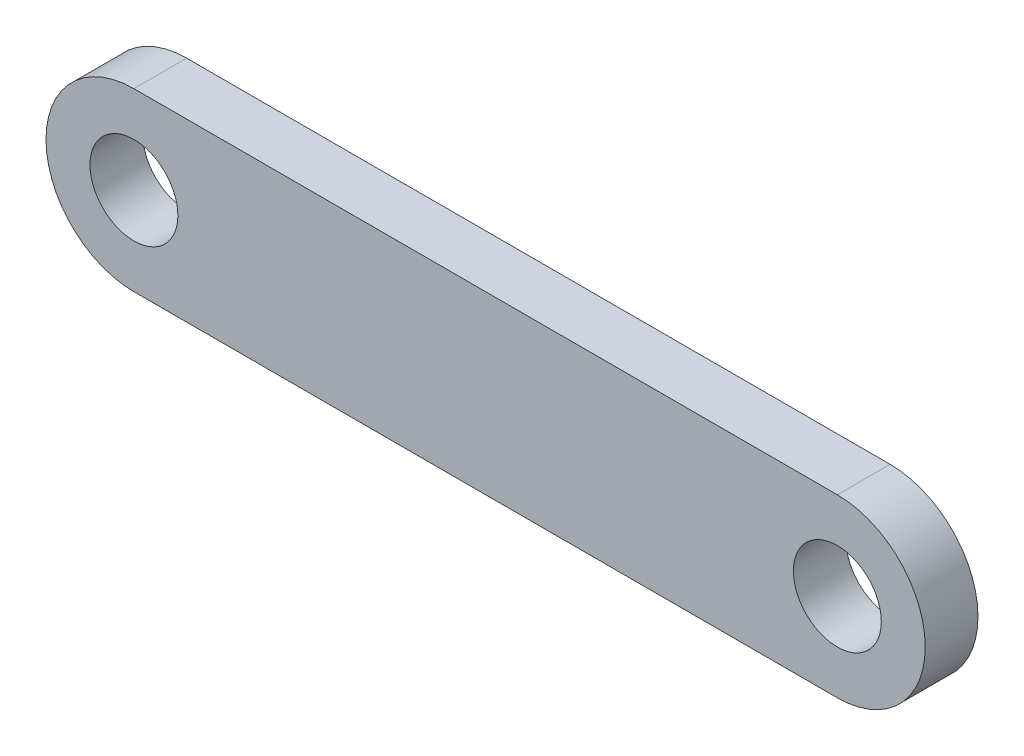
ISO-10303-21;
HEADER;
FILE_DESCRIPTION(('STEP AP214'),'2;1');
FILE_NAME('part.step','',(''),(''),'','','');
FILE_SCHEMA(('AUTOMOTIVE_DESIGN { 1 0 10303 214 1 1 1 1 }'));
ENDSEC;
DATA;
#1=APPLICATION_CONTEXT('core data for automotive mechanical design processes');
#2=APPLICATION_PROTOCOL_DEFINITION('international standard','automotive_design',2000,#1);
#3=PRODUCT_CONTEXT('',#1,'mechanical');
#4=PRODUCT('Part','Part','',(#3));
#5=PRODUCT_RELATED_PRODUCT_CATEGORY('part','',(#4));
#6=PRODUCT_DEFINITION_FORMATION('','',#4);
#7=PRODUCT_DEFINITION_CONTEXT('part definition',#1,'design');
#8=PRODUCT_DEFINITION('design','',#6,#7);
#9=PRODUCT_DEFINITION_SHAPE('','',#8);
#10=(LENGTH_UNIT() NAMED_UNIT(*) SI_UNIT(.MILLI.,.METRE.));
#11=(NAMED_UNIT(*) PLANE_ANGLE_UNIT() SI_UNIT($,.RADIAN.));
#12=(NAMED_UNIT(*) SI_UNIT($,.STERADIAN.) SOLID_ANGLE_UNIT());
#13=UNCERTAINTY_MEASURE_WITH_UNIT(LENGTH_MEASURE(1.E-05),#10,'distance_accuracy_value','');
#14=(GEOMETRIC_REPRESENTATION_CONTEXT(3) GLOBAL_UNCERTAINTY_ASSIGNED_CONTEXT((#13)) GLOBAL_UNIT_ASSIGNED_CONTEXT((#10,
#11,#12)) REPRESENTATION_CONTEXT('',''));
#15=CARTESIAN_POINT('',(0.,0.,0.));
#16=DIRECTION('',(0.,0.,1.));
#17=DIRECTION('',(1.,0.,0.));
#18=AXIS2_PLACEMENT_3D('',#15,#16,#17);
#19=CARTESIAN_POINT('',(10.,-5.,-3.));
#20=DIRECTION('',(0.,1.,0.));
#21=DIRECTION('',(-1.,0.,0.));
#22=AXIS2_PLACEMENT_3D('',#19,#20,#21);
#23=PLANE('',#22);
#24=DIRECTION('',(-1.,0.,0.));
#25=VECTOR('',#24,1.);
#26=CARTESIAN_POINT('',(10.,-5.,0.));
#27=LINE('',#26,#25);
#28=CARTESIAN_POINT('',(20.,-5.,0.));
#29=VERTEX_POINT('',#28);
#30=CARTESIAN_POINT('',(-20.,-5.,0.));
#31=VERTEX_POINT('',#30);
#32=EDGE_CURVE('E45',#29,#31,#27,.T.);
#33=ORIENTED_EDGE('',*,*,#32,.T.);
#34=DIRECTION('',(0.,0.,1.));
#35=VECTOR('',#34,1.);
#36=CARTESIAN_POINT('',(-20.,-5.,-21.0277563773199));
#37=LINE('',#36,#35);
#38=CARTESIAN_POINT('',(-20.,-5.,-3.));
#39=VERTEX_POINT('',#38);
#40=EDGE_CURVE('E87',#39,#31,#37,.T.);
#41=ORIENTED_EDGE('',*,*,#40,.F.);
#42=DIRECTION('',(-1.,0.,0.));
#43=VECTOR('',#42,1.);
#44=CARTESIAN_POINT('',(10.,-5.,-3.));
#45=LINE('',#44,#43);
#46=CARTESIAN_POINT('',(20.,-5.,-3.));
#47=VERTEX_POINT('',#46);
#48=EDGE_CURVE('E11',#47,#39,#45,.T.);
#49=ORIENTED_EDGE('',*,*,#48,.F.);
#50=DIRECTION('',(0.,0.,1.));
#51=VECTOR('',#50,1.);
#52=CARTESIAN_POINT('',(20.,-5.,-21.0277563773199));
#53=LINE('',#52,#51);
#54=EDGE_CURVE('E114',#47,#29,#53,.T.);
#55=ORIENTED_EDGE('',*,*,#54,.T.);
#56=EDGE_LOOP('',(#33,#41,#49,#55));
#57=FACE_BOUND('',#56,.T.);
#58=ADVANCED_FACE('F41',(#57),#23,.F.);
#59=CARTESIAN_POINT('',(10.,5.,-3.));
#60=DIRECTION('',(0.,1.,0.));
#61=DIRECTION('',(-1.,0.,0.));
#62=AXIS2_PLACEMENT_3D('',#59,#60,#61);
#63=PLANE('',#62);
#64=DIRECTION('',(-1.,0.,0.));
#65=VECTOR('',#64,1.);
#66=CARTESIAN_POINT('',(10.,5.,-3.));
#67=LINE('',#66,#65);
#68=CARTESIAN_POINT('',(20.,5.,-3.));
#69=VERTEX_POINT('',#68);
#70=CARTESIAN_POINT('',(-20.,5.,-3.));
#71=VERTEX_POINT('',#70);
#72=EDGE_CURVE('E50',#69,#71,#67,.T.);
#73=ORIENTED_EDGE('',*,*,#72,.T.);
#74=DIRECTION('',(0.,0.,1.));
#75=VECTOR('',#74,1.);
#76=CARTESIAN_POINT('',(-20.,5.,-21.0277563773199));
#77=LINE('',#76,#75);
#78=CARTESIAN_POINT('',(-20.,5.,0.));
#79=VERTEX_POINT('',#78);
#80=EDGE_CURVE('E95',#71,#79,#77,.T.);
#81=ORIENTED_EDGE('',*,*,#80,.T.);
#82=DIRECTION('',(-1.,0.,0.));
#83=VECTOR('',#82,1.);
#84=CARTESIAN_POINT('',(10.,5.,0.));
#85=LINE('',#84,#83);
#86=CARTESIAN_POINT('',(20.,5.,0.));
#87=VERTEX_POINT('',#86);
#88=EDGE_CURVE('E120',#87,#79,#85,.T.);
#89=ORIENTED_EDGE('',*,*,#88,.F.);
#90=DIRECTION('',(0.,0.,1.));
#91=VECTOR('',#90,1.);
#92=CARTESIAN_POINT('',(20.,5.,-21.0277563773199));
#93=LINE('',#92,#91);
#94=EDGE_CURVE('E108',#69,#87,#93,.T.);
#95=ORIENTED_EDGE('',*,*,#94,.F.);
#96=EDGE_LOOP('',(#73,#81,#89,#95));
#97=FACE_BOUND('',#96,.T.);
#98=ADVANCED_FACE('F43',(#97),#63,.T.);
#99=CARTESIAN_POINT('',(0.,0.,-3.));
#100=DIRECTION('',(0.,0.,1.));
#101=DIRECTION('',(1.,0.,0.));
#102=AXIS2_PLACEMENT_3D('',#99,#100,#101);
#103=PLANE('',#102);
#104=ORIENTED_EDGE('',*,*,#48,.T.);
#105=CARTESIAN_POINT('',(-20.,0.,-3.));
#106=DIRECTION('',(0.,0.,1.));
#107=DIRECTION('',(1.,0.,0.));
#108=AXIS2_PLACEMENT_3D('',#105,#106,#107);
#109=CIRCLE('',#108,5.);
#110=EDGE_CURVE('E82',#71,#39,#109,.T.);
#111=ORIENTED_EDGE('',*,*,#110,.F.);
#112=ORIENTED_EDGE('',*,*,#72,.F.);
#113=CARTESIAN_POINT('',(20.,0.,-3.));
#114=DIRECTION('',(0.,0.,1.));
#115=DIRECTION('',(1.,0.,0.));
#116=AXIS2_PLACEMENT_3D('',#113,#114,#115);
#117=CIRCLE('',#116,5.);
#118=EDGE_CURVE('E84',#69,#47,#117,.F.);
#119=ORIENTED_EDGE('',*,*,#118,.T.);
#120=EDGE_LOOP('',(#104,#111,#112,#119));
#121=FACE_BOUND('',#120,.T.);
#122=CARTESIAN_POINT('',(20.,0.,-3.));
#123=DIRECTION('',(0.,0.,1.));
#124=DIRECTION('',(1.,0.,0.));
#125=AXIS2_PLACEMENT_3D('',#122,#123,#124);
#126=CIRCLE('',#125,2.49999999999999);
#127=CARTESIAN_POINT('',(22.5,0.,-3.));
#128=VERTEX_POINT('',#127);
#129=EDGE_CURVE('E107',#128,#128,#126,.F.);
#130=ORIENTED_EDGE('',*,*,#129,.F.);
#131=EDGE_LOOP('',(#130));
#132=FACE_BOUND('',#131,.T.);
#133=CARTESIAN_POINT('',(-20.,0.,-3.));
#134=DIRECTION('',(0.,0.,1.));
#135=DIRECTION('',(1.,0.,0.));
#136=AXIS2_PLACEMENT_3D('',#133,#134,#135);
#137=CIRCLE('',#136,2.49999999999999);
#138=CARTESIAN_POINT('',(-17.5,0.,-3.));
#139=VERTEX_POINT('',#138);
#140=EDGE_CURVE('E102',#139,#139,#137,.T.);
#141=ORIENTED_EDGE('',*,*,#140,.T.);
#142=EDGE_LOOP('',(#141));
#143=FACE_BOUND('',#142,.T.);
#144=ADVANCED_FACE('F79',(#121,#132,#143),#103,.F.);
#145=CARTESIAN_POINT('',(0.,0.,0.));
#146=DIRECTION('',(0.,0.,1.));
#147=DIRECTION('',(1.,0.,0.));
#148=AXIS2_PLACEMENT_3D('',#145,#146,#147);
#149=PLANE('',#148);
#150=ORIENTED_EDGE('',*,*,#88,.T.);
#151=CARTESIAN_POINT('',(-20.,0.,0.));
#152=DIRECTION('',(0.,0.,-1.));
#153=DIRECTION('',(1.,0.,0.));
#154=AXIS2_PLACEMENT_3D('',#151,#152,#153);
#155=CIRCLE('',#154,5.);
#156=EDGE_CURVE('E91',#31,#79,#155,.T.);
#157=ORIENTED_EDGE('',*,*,#156,.F.);
#158=ORIENTED_EDGE('',*,*,#32,.F.);
#159=CARTESIAN_POINT('',(20.,0.,0.));
#160=DIRECTION('',(0.,0.,1.));
#161=DIRECTION('',(-1.,0.,0.));
#162=AXIS2_PLACEMENT_3D('',#159,#160,#161);
#163=CIRCLE('',#162,5.);
#164=EDGE_CURVE('E111',#29,#87,#163,.T.);
#165=ORIENTED_EDGE('',*,*,#164,.T.);
#166=EDGE_LOOP('',(#150,#157,#158,#165));
#167=FACE_BOUND('',#166,.T.);
#168=CARTESIAN_POINT('',(20.,0.,0.));
#169=DIRECTION('',(0.,0.,1.));
#170=DIRECTION('',(1.,0.,0.));
#171=AXIS2_PLACEMENT_3D('',#168,#169,#170);
#172=CIRCLE('',#171,2.49999999999999);
#173=CARTESIAN_POINT('',(22.5,0.,0.));
#174=VERTEX_POINT('',#173);
#175=EDGE_CURVE('E105',#174,#174,#172,.T.);
#176=ORIENTED_EDGE('',*,*,#175,.F.);
#177=EDGE_LOOP('',(#176));
#178=FACE_BOUND('',#177,.T.);
#179=CARTESIAN_POINT('',(-20.,0.,0.));
#180=DIRECTION('',(0.,0.,-1.));
#181=DIRECTION('',(-1.,0.,0.));
#182=AXIS2_PLACEMENT_3D('',#179,#180,#181);
#183=CIRCLE('',#182,2.49999999999999);
#184=CARTESIAN_POINT('',(-22.5,0.,0.));
#185=VERTEX_POINT('',#184);
#186=EDGE_CURVE('E96',#185,#185,#183,.T.);
#187=ORIENTED_EDGE('',*,*,#186,.T.);
#188=EDGE_LOOP('',(#187));
#189=FACE_BOUND('',#188,.T.);
#190=ADVANCED_FACE('F122',(#167,#178,#189),#149,.T.);
#191=CARTESIAN_POINT('',(20.,0.,-21.0277563773199));
#192=DIRECTION('',(0.,0.,1.));
#193=DIRECTION('',(1.,0.,0.));
#194=AXIS2_PLACEMENT_3D('',#191,#192,#193);
#195=CYLINDRICAL_SURFACE('',#194,5.);
#196=ORIENTED_EDGE('',*,*,#118,.F.);
#197=ORIENTED_EDGE('',*,*,#94,.T.);
#198=ORIENTED_EDGE('',*,*,#164,.F.);
#199=ORIENTED_EDGE('',*,*,#54,.F.);
#200=EDGE_LOOP('',(#196,#197,#198,#199));
#201=FACE_BOUND('',#200,.T.);
#202=ADVANCED_FACE('F129',(#201),#195,.T.);
#203=CARTESIAN_POINT('',(20.,0.,-21.0277563773199));
#204=DIRECTION('',(0.,0.,1.));
#205=DIRECTION('',(1.,0.,0.));
#206=AXIS2_PLACEMENT_3D('',#203,#204,#205);
#207=CYLINDRICAL_SURFACE('',#206,2.49999999999999);
#208=ORIENTED_EDGE('',*,*,#129,.T.);
#209=EDGE_LOOP('',(#208));
#210=FACE_BOUND('',#209,.T.);
#211=ORIENTED_EDGE('',*,*,#175,.T.);
#212=EDGE_LOOP('',(#211));
#213=FACE_BOUND('',#212,.T.);
#214=ADVANCED_FACE('F131',(#210,#213),#207,.F.);
#215=CARTESIAN_POINT('',(-20.,0.,-21.0277563773199));
#216=DIRECTION('',(0.,0.,1.));
#217=DIRECTION('',(1.,0.,0.));
#218=AXIS2_PLACEMENT_3D('',#215,#216,#217);
#219=CYLINDRICAL_SURFACE('',#218,5.);
#220=ORIENTED_EDGE('',*,*,#80,.F.);
#221=ORIENTED_EDGE('',*,*,#110,.T.);
#222=ORIENTED_EDGE('',*,*,#40,.T.);
#223=ORIENTED_EDGE('',*,*,#156,.T.);
#224=EDGE_LOOP('',(#220,#221,#222,#223));
#225=FACE_BOUND('',#224,.T.);
#226=ADVANCED_FACE('F93',(#225),#219,.T.);
#227=CARTESIAN_POINT('',(-20.,0.,-21.0277563773199));
#228=DIRECTION('',(0.,0.,1.));
#229=DIRECTION('',(1.,0.,0.));
#230=AXIS2_PLACEMENT_3D('',#227,#228,#229);
#231=CYLINDRICAL_SURFACE('',#230,2.49999999999999);
#232=ORIENTED_EDGE('',*,*,#140,.F.);
#233=EDGE_LOOP('',(#232));
#234=FACE_BOUND('',#233,.T.);
#235=ORIENTED_EDGE('',*,*,#186,.F.);
#236=EDGE_LOOP('',(#235));
#237=FACE_BOUND('',#236,.T.);
#238=ADVANCED_FACE('F164',(#234,#237),#231,.F.);
#239=CLOSED_SHELL('',(#58,#98,#144,#190,#202,#214,#226,#238));
#240=MANIFOLD_SOLID_BREP('B2',#239);
#241=ADVANCED_BREP_SHAPE_REPRESENTATION('',(#18,#240),#14);
#242=SHAPE_DEFINITION_REPRESENTATION(#9,#241);
ENDSEC;
END-ISO-10303-21;
